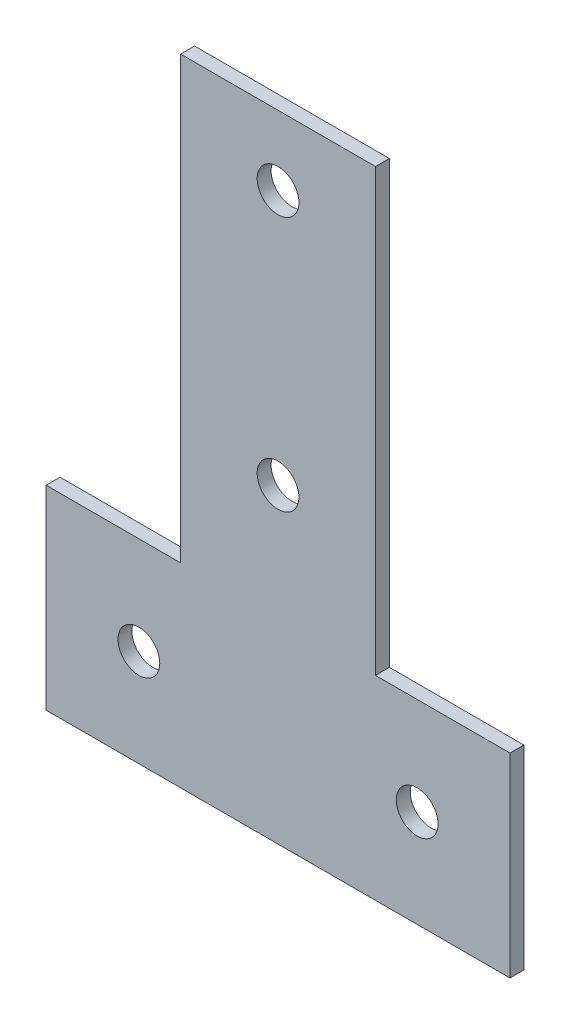
ISO-10303-21;
HEADER;
FILE_DESCRIPTION(('STEP AP214'),'2;1');
FILE_NAME('part.step','',(''),(''),'','','');
FILE_SCHEMA(('AUTOMOTIVE_DESIGN { 1 0 10303 214 1 1 1 1 }'));
ENDSEC;
DATA;
#1=APPLICATION_CONTEXT('core data for automotive mechanical design processes');
#2=APPLICATION_PROTOCOL_DEFINITION('international standard','automotive_design',2000,#1);
#3=PRODUCT_CONTEXT('',#1,'mechanical');
#4=PRODUCT('Part','Part','',(#3));
#5=PRODUCT_RELATED_PRODUCT_CATEGORY('part','',(#4));
#6=PRODUCT_DEFINITION_FORMATION('','',#4);
#7=PRODUCT_DEFINITION_CONTEXT('part definition',#1,'design');
#8=PRODUCT_DEFINITION('design','',#6,#7);
#9=PRODUCT_DEFINITION_SHAPE('','',#8);
#10=(LENGTH_UNIT() NAMED_UNIT(*) SI_UNIT(.MILLI.,.METRE.));
#11=(NAMED_UNIT(*) PLANE_ANGLE_UNIT() SI_UNIT($,.RADIAN.));
#12=(NAMED_UNIT(*) SI_UNIT($,.STERADIAN.) SOLID_ANGLE_UNIT());
#13=UNCERTAINTY_MEASURE_WITH_UNIT(LENGTH_MEASURE(1.E-05),#10,'distance_accuracy_value','');
#14=(GEOMETRIC_REPRESENTATION_CONTEXT(3) GLOBAL_UNCERTAINTY_ASSIGNED_CONTEXT((#13)) GLOBAL_UNIT_ASSIGNED_CONTEXT((#10,
#11,#12)) REPRESENTATION_CONTEXT('',''));
#15=CARTESIAN_POINT('',(0.,0.,0.));
#16=DIRECTION('',(0.,0.,1.));
#17=DIRECTION('',(1.,0.,0.));
#18=AXIS2_PLACEMENT_3D('',#15,#16,#17);
#19=CARTESIAN_POINT('',(0.,0.,3.));
#20=DIRECTION('',(0.,0.,1.));
#21=DIRECTION('',(1.,0.,0.));
#22=AXIS2_PLACEMENT_3D('',#19,#20,#21);
#23=PLANE('',#22);
#24=CARTESIAN_POINT('',(-30.,21.,3.));
#25=DIRECTION('',(0.,0.,1.));
#26=DIRECTION('',(1.,0.,0.));
#27=AXIS2_PLACEMENT_3D('',#24,#25,#26);
#28=CIRCLE('',#27,4.5);
#29=CARTESIAN_POINT('',(-25.5,21.,3.));
#30=VERTEX_POINT('',#29);
#31=EDGE_CURVE('E189',#30,#30,#28,.T.);
#32=ORIENTED_EDGE('',*,*,#31,.F.);
#33=EDGE_LOOP('',(#32));
#34=FACE_BOUND('',#33,.T.);
#35=CARTESIAN_POINT('',(0.,122.,3.));
#36=DIRECTION('',(0.,0.,1.));
#37=DIRECTION('',(1.,0.,0.));
#38=AXIS2_PLACEMENT_3D('',#35,#36,#37);
#39=CIRCLE('',#38,4.5);
#40=CARTESIAN_POINT('',(4.5,122.,3.));
#41=VERTEX_POINT('',#40);
#42=EDGE_CURVE('E135',#41,#41,#39,.T.);
#43=ORIENTED_EDGE('',*,*,#42,.F.);
#44=EDGE_LOOP('',(#43));
#45=FACE_BOUND('',#44,.T.);
#46=DIRECTION('',(0.,1.,0.));
#47=VECTOR('',#46,1.);
#48=CARTESIAN_POINT('',(50.,42.,3.));
#49=LINE('',#48,#47);
#50=CARTESIAN_POINT('',(50.,0.,3.));
#51=VERTEX_POINT('',#50);
#52=CARTESIAN_POINT('',(50.,42.,3.));
#53=VERTEX_POINT('',#52);
#54=EDGE_CURVE('E146',#51,#53,#49,.T.);
#55=ORIENTED_EDGE('',*,*,#54,.T.);
#56=DIRECTION('',(-1.,0.,0.));
#57=VECTOR('',#56,1.);
#58=CARTESIAN_POINT('',(21.,42.,3.));
#59=LINE('',#58,#57);
#60=CARTESIAN_POINT('',(21.,42.,3.));
#61=VERTEX_POINT('',#60);
#62=EDGE_CURVE('E94',#53,#61,#59,.T.);
#63=ORIENTED_EDGE('',*,*,#62,.T.);
#64=DIRECTION('',(0.,1.,0.));
#65=VECTOR('',#64,1.);
#66=CARTESIAN_POINT('',(21.,137.,3.));
#67=LINE('',#66,#65);
#68=CARTESIAN_POINT('',(21.,137.,3.));
#69=VERTEX_POINT('',#68);
#70=EDGE_CURVE('E161',#61,#69,#67,.T.);
#71=ORIENTED_EDGE('',*,*,#70,.T.);
#72=DIRECTION('',(-1.,0.,0.));
#73=VECTOR('',#72,1.);
#74=CARTESIAN_POINT('',(-21.,137.,3.));
#75=LINE('',#74,#73);
#76=CARTESIAN_POINT('',(-21.,137.,3.));
#77=VERTEX_POINT('',#76);
#78=EDGE_CURVE('E174',#69,#77,#75,.T.);
#79=ORIENTED_EDGE('',*,*,#78,.T.);
#80=DIRECTION('',(0.,-1.,0.));
#81=VECTOR('',#80,1.);
#82=CARTESIAN_POINT('',(-21.,42.,3.));
#83=LINE('',#82,#81);
#84=CARTESIAN_POINT('',(-21.,42.,3.));
#85=VERTEX_POINT('',#84);
#86=EDGE_CURVE('E113',#77,#85,#83,.T.);
#87=ORIENTED_EDGE('',*,*,#86,.T.);
#88=DIRECTION('',(-1.,0.,0.));
#89=VECTOR('',#88,1.);
#90=CARTESIAN_POINT('',(-50.,42.,3.));
#91=LINE('',#90,#89);
#92=CARTESIAN_POINT('',(-50.,42.,3.));
#93=VERTEX_POINT('',#92);
#94=EDGE_CURVE('E107',#85,#93,#91,.T.);
#95=ORIENTED_EDGE('',*,*,#94,.T.);
#96=DIRECTION('',(0.,-1.,0.));
#97=VECTOR('',#96,1.);
#98=CARTESIAN_POINT('',(-50.,0.,3.));
#99=LINE('',#98,#97);
#100=CARTESIAN_POINT('',(-50.,0.,3.));
#101=VERTEX_POINT('',#100);
#102=EDGE_CURVE('E111',#93,#101,#99,.T.);
#103=ORIENTED_EDGE('',*,*,#102,.T.);
#104=DIRECTION('',(1.,0.,0.));
#105=VECTOR('',#104,1.);
#106=CARTESIAN_POINT('',(-50.,0.,3.));
#107=LINE('',#106,#105);
#108=EDGE_CURVE('E51',#101,#51,#107,.T.);
#109=ORIENTED_EDGE('',*,*,#108,.T.);
#110=EDGE_LOOP('',(#55,#63,#71,#79,#87,#95,#103,#109));
#111=FACE_BOUND('',#110,.T.);
#112=CARTESIAN_POINT('',(0.,67.,3.));
#113=DIRECTION('',(0.,0.,1.));
#114=DIRECTION('',(1.,0.,0.));
#115=AXIS2_PLACEMENT_3D('',#112,#113,#114);
#116=CIRCLE('',#115,4.5);
#117=CARTESIAN_POINT('',(4.5,67.,3.));
#118=VERTEX_POINT('',#117);
#119=EDGE_CURVE('E183',#118,#118,#116,.T.);
#120=ORIENTED_EDGE('',*,*,#119,.F.);
#121=EDGE_LOOP('',(#120));
#122=FACE_BOUND('',#121,.T.);
#123=CARTESIAN_POINT('',(30.,21.,3.));
#124=DIRECTION('',(0.,0.,1.));
#125=DIRECTION('',(1.,0.,0.));
#126=AXIS2_PLACEMENT_3D('',#123,#124,#125);
#127=CIRCLE('',#126,4.5);
#128=CARTESIAN_POINT('',(34.5,21.,3.));
#129=VERTEX_POINT('',#128);
#130=EDGE_CURVE('E195',#129,#129,#127,.T.);
#131=ORIENTED_EDGE('',*,*,#130,.F.);
#132=EDGE_LOOP('',(#131));
#133=FACE_BOUND('',#132,.T.);
#134=ADVANCED_FACE('F34',(#34,#45,#111,#122,#133),#23,.T.);
#135=CARTESIAN_POINT('',(0.,0.,0.));
#136=DIRECTION('',(0.,0.,1.));
#137=DIRECTION('',(1.,0.,0.));
#138=AXIS2_PLACEMENT_3D('',#135,#136,#137);
#139=PLANE('',#138);
#140=DIRECTION('',(0.,1.,0.));
#141=VECTOR('',#140,1.);
#142=CARTESIAN_POINT('',(50.,42.,0.));
#143=LINE('',#142,#141);
#144=CARTESIAN_POINT('',(50.,0.,0.));
#145=VERTEX_POINT('',#144);
#146=CARTESIAN_POINT('',(50.,42.,0.));
#147=VERTEX_POINT('',#146);
#148=EDGE_CURVE('E131',#145,#147,#143,.T.);
#149=ORIENTED_EDGE('',*,*,#148,.F.);
#150=DIRECTION('',(1.,0.,0.));
#151=VECTOR('',#150,1.);
#152=CARTESIAN_POINT('',(-50.,0.,0.));
#153=LINE('',#152,#151);
#154=CARTESIAN_POINT('',(-50.,0.,0.));
#155=VERTEX_POINT('',#154);
#156=EDGE_CURVE('E86',#155,#145,#153,.T.);
#157=ORIENTED_EDGE('',*,*,#156,.F.);
#158=DIRECTION('',(0.,-1.,0.));
#159=VECTOR('',#158,1.);
#160=CARTESIAN_POINT('',(-50.,0.,0.));
#161=LINE('',#160,#159);
#162=CARTESIAN_POINT('',(-50.,42.,0.));
#163=VERTEX_POINT('',#162);
#164=EDGE_CURVE('E80',#163,#155,#161,.T.);
#165=ORIENTED_EDGE('',*,*,#164,.F.);
#166=DIRECTION('',(-1.,0.,0.));
#167=VECTOR('',#166,1.);
#168=CARTESIAN_POINT('',(-50.,42.,0.));
#169=LINE('',#168,#167);
#170=CARTESIAN_POINT('',(-21.,42.,0.));
#171=VERTEX_POINT('',#170);
#172=EDGE_CURVE('E121',#171,#163,#169,.T.);
#173=ORIENTED_EDGE('',*,*,#172,.F.);
#174=DIRECTION('',(0.,-1.,0.));
#175=VECTOR('',#174,1.);
#176=CARTESIAN_POINT('',(-21.,42.,0.));
#177=LINE('',#176,#175);
#178=CARTESIAN_POINT('',(-21.,137.,0.));
#179=VERTEX_POINT('',#178);
#180=EDGE_CURVE('E141',#179,#171,#177,.T.);
#181=ORIENTED_EDGE('',*,*,#180,.F.);
#182=DIRECTION('',(-1.,0.,0.));
#183=VECTOR('',#182,1.);
#184=CARTESIAN_POINT('',(-21.,137.,0.));
#185=LINE('',#184,#183);
#186=CARTESIAN_POINT('',(21.,137.,0.));
#187=VERTEX_POINT('',#186);
#188=EDGE_CURVE('E139',#187,#179,#185,.T.);
#189=ORIENTED_EDGE('',*,*,#188,.F.);
#190=DIRECTION('',(0.,1.,0.));
#191=VECTOR('',#190,1.);
#192=CARTESIAN_POINT('',(21.,137.,0.));
#193=LINE('',#192,#191);
#194=CARTESIAN_POINT('',(21.,42.,0.));
#195=VERTEX_POINT('',#194);
#196=EDGE_CURVE('E137',#195,#187,#193,.T.);
#197=ORIENTED_EDGE('',*,*,#196,.F.);
#198=DIRECTION('',(-1.,0.,0.));
#199=VECTOR('',#198,1.);
#200=CARTESIAN_POINT('',(21.,42.,0.));
#201=LINE('',#200,#199);
#202=EDGE_CURVE('E134',#147,#195,#201,.T.);
#203=ORIENTED_EDGE('',*,*,#202,.F.);
#204=EDGE_LOOP('',(#149,#157,#165,#173,#181,#189,#197,#203));
#205=FACE_BOUND('',#204,.T.);
#206=CARTESIAN_POINT('',(0.,122.,0.));
#207=DIRECTION('',(0.,0.,1.));
#208=DIRECTION('',(1.,0.,0.));
#209=AXIS2_PLACEMENT_3D('',#206,#207,#208);
#210=CIRCLE('',#209,4.5);
#211=CARTESIAN_POINT('',(4.5,122.,0.));
#212=VERTEX_POINT('',#211);
#213=EDGE_CURVE('E180',#212,#212,#210,.T.);
#214=ORIENTED_EDGE('',*,*,#213,.T.);
#215=EDGE_LOOP('',(#214));
#216=FACE_BOUND('',#215,.T.);
#217=CARTESIAN_POINT('',(0.,67.,0.));
#218=DIRECTION('',(0.,0.,1.));
#219=DIRECTION('',(1.,0.,0.));
#220=AXIS2_PLACEMENT_3D('',#217,#218,#219);
#221=CIRCLE('',#220,4.5);
#222=CARTESIAN_POINT('',(4.5,67.,0.));
#223=VERTEX_POINT('',#222);
#224=EDGE_CURVE('E186',#223,#223,#221,.T.);
#225=ORIENTED_EDGE('',*,*,#224,.T.);
#226=EDGE_LOOP('',(#225));
#227=FACE_BOUND('',#226,.T.);
#228=CARTESIAN_POINT('',(-30.,21.,0.));
#229=DIRECTION('',(0.,0.,1.));
#230=DIRECTION('',(1.,0.,0.));
#231=AXIS2_PLACEMENT_3D('',#228,#229,#230);
#232=CIRCLE('',#231,4.5);
#233=CARTESIAN_POINT('',(-25.5,21.,0.));
#234=VERTEX_POINT('',#233);
#235=EDGE_CURVE('E192',#234,#234,#232,.T.);
#236=ORIENTED_EDGE('',*,*,#235,.T.);
#237=EDGE_LOOP('',(#236));
#238=FACE_BOUND('',#237,.T.);
#239=CARTESIAN_POINT('',(30.,21.,0.));
#240=DIRECTION('',(0.,0.,1.));
#241=DIRECTION('',(1.,0.,0.));
#242=AXIS2_PLACEMENT_3D('',#239,#240,#241);
#243=CIRCLE('',#242,4.5);
#244=CARTESIAN_POINT('',(34.5,21.,0.));
#245=VERTEX_POINT('',#244);
#246=EDGE_CURVE('E198',#245,#245,#243,.T.);
#247=ORIENTED_EDGE('',*,*,#246,.T.);
#248=EDGE_LOOP('',(#247));
#249=FACE_BOUND('',#248,.T.);
#250=ADVANCED_FACE('F165',(#205,#216,#227,#238,#249),#139,.F.);
#251=CARTESIAN_POINT('',(50.,42.,3.));
#252=DIRECTION('',(-1.,0.,0.));
#253=DIRECTION('',(0.,0.,1.));
#254=AXIS2_PLACEMENT_3D('',#251,#252,#253);
#255=PLANE('',#254);
#256=ORIENTED_EDGE('',*,*,#148,.T.);
#257=DIRECTION('',(0.,0.,-1.));
#258=VECTOR('',#257,1.);
#259=CARTESIAN_POINT('',(50.,42.,3.));
#260=LINE('',#259,#258);
#261=EDGE_CURVE('E11',#53,#147,#260,.T.);
#262=ORIENTED_EDGE('',*,*,#261,.F.);
#263=ORIENTED_EDGE('',*,*,#54,.F.);
#264=DIRECTION('',(0.,0.,-1.));
#265=VECTOR('',#264,1.);
#266=CARTESIAN_POINT('',(50.,0.,3.));
#267=LINE('',#266,#265);
#268=EDGE_CURVE('E127',#51,#145,#267,.T.);
#269=ORIENTED_EDGE('',*,*,#268,.T.);
#270=EDGE_LOOP('',(#256,#262,#263,#269));
#271=FACE_BOUND('',#270,.T.);
#272=ADVANCED_FACE('F36',(#271),#255,.F.);
#273=CARTESIAN_POINT('',(21.,42.,3.));
#274=DIRECTION('',(0.,-1.,0.));
#275=DIRECTION('',(0.,0.,-1.));
#276=AXIS2_PLACEMENT_3D('',#273,#274,#275);
#277=PLANE('',#276);
#278=ORIENTED_EDGE('',*,*,#202,.T.);
#279=DIRECTION('',(0.,0.,-1.));
#280=VECTOR('',#279,1.);
#281=CARTESIAN_POINT('',(21.,42.,3.));
#282=LINE('',#281,#280);
#283=EDGE_CURVE('E43',#61,#195,#282,.T.);
#284=ORIENTED_EDGE('',*,*,#283,.F.);
#285=ORIENTED_EDGE('',*,*,#62,.F.);
#286=ORIENTED_EDGE('',*,*,#261,.T.);
#287=EDGE_LOOP('',(#278,#284,#285,#286));
#288=FACE_BOUND('',#287,.T.);
#289=ADVANCED_FACE('F232',(#288),#277,.F.);
#290=CARTESIAN_POINT('',(21.,137.,3.));
#291=DIRECTION('',(-1.,0.,0.));
#292=DIRECTION('',(0.,0.,1.));
#293=AXIS2_PLACEMENT_3D('',#290,#291,#292);
#294=PLANE('',#293);
#295=ORIENTED_EDGE('',*,*,#196,.T.);
#296=DIRECTION('',(0.,0.,-1.));
#297=VECTOR('',#296,1.);
#298=CARTESIAN_POINT('',(21.,137.,3.));
#299=LINE('',#298,#297);
#300=EDGE_CURVE('E153',#69,#187,#299,.T.);
#301=ORIENTED_EDGE('',*,*,#300,.F.);
#302=ORIENTED_EDGE('',*,*,#70,.F.);
#303=ORIENTED_EDGE('',*,*,#283,.T.);
#304=EDGE_LOOP('',(#295,#301,#302,#303));
#305=FACE_BOUND('',#304,.T.);
#306=ADVANCED_FACE('F159',(#305),#294,.F.);
#307=CARTESIAN_POINT('',(-21.,137.,3.));
#308=DIRECTION('',(0.,-1.,0.));
#309=DIRECTION('',(0.,0.,-1.));
#310=AXIS2_PLACEMENT_3D('',#307,#308,#309);
#311=PLANE('',#310);
#312=ORIENTED_EDGE('',*,*,#188,.T.);
#313=DIRECTION('',(0.,0.,-1.));
#314=VECTOR('',#313,1.);
#315=CARTESIAN_POINT('',(-21.,137.,3.));
#316=LINE('',#315,#314);
#317=EDGE_CURVE('E150',#77,#179,#316,.T.);
#318=ORIENTED_EDGE('',*,*,#317,.F.);
#319=ORIENTED_EDGE('',*,*,#78,.F.);
#320=ORIENTED_EDGE('',*,*,#300,.T.);
#321=EDGE_LOOP('',(#312,#318,#319,#320));
#322=FACE_BOUND('',#321,.T.);
#323=ADVANCED_FACE('F170',(#322),#311,.F.);
#324=CARTESIAN_POINT('',(-21.,42.,3.));
#325=DIRECTION('',(1.,0.,0.));
#326=DIRECTION('',(0.,0.,-1.));
#327=AXIS2_PLACEMENT_3D('',#324,#325,#326);
#328=PLANE('',#327);
#329=ORIENTED_EDGE('',*,*,#180,.T.);
#330=DIRECTION('',(0.,0.,-1.));
#331=VECTOR('',#330,1.);
#332=CARTESIAN_POINT('',(-21.,42.,3.));
#333=LINE('',#332,#331);
#334=EDGE_CURVE('E122',#85,#171,#333,.T.);
#335=ORIENTED_EDGE('',*,*,#334,.F.);
#336=ORIENTED_EDGE('',*,*,#86,.F.);
#337=ORIENTED_EDGE('',*,*,#317,.T.);
#338=EDGE_LOOP('',(#329,#335,#336,#337));
#339=FACE_BOUND('',#338,.T.);
#340=ADVANCED_FACE('F173',(#339),#328,.F.);
#341=CARTESIAN_POINT('',(-50.,42.,3.));
#342=DIRECTION('',(0.,-1.,0.));
#343=DIRECTION('',(0.,0.,-1.));
#344=AXIS2_PLACEMENT_3D('',#341,#342,#343);
#345=PLANE('',#344);
#346=ORIENTED_EDGE('',*,*,#172,.T.);
#347=DIRECTION('',(0.,0.,-1.));
#348=VECTOR('',#347,1.);
#349=CARTESIAN_POINT('',(-50.,42.,3.));
#350=LINE('',#349,#348);
#351=EDGE_CURVE('E118',#93,#163,#350,.T.);
#352=ORIENTED_EDGE('',*,*,#351,.F.);
#353=ORIENTED_EDGE('',*,*,#94,.F.);
#354=ORIENTED_EDGE('',*,*,#334,.T.);
#355=EDGE_LOOP('',(#346,#352,#353,#354));
#356=FACE_BOUND('',#355,.T.);
#357=ADVANCED_FACE('F119',(#356),#345,.F.);
#358=CARTESIAN_POINT('',(-50.,0.,3.));
#359=DIRECTION('',(1.,0.,0.));
#360=DIRECTION('',(0.,0.,-1.));
#361=AXIS2_PLACEMENT_3D('',#358,#359,#360);
#362=PLANE('',#361);
#363=ORIENTED_EDGE('',*,*,#164,.T.);
#364=DIRECTION('',(0.,0.,-1.));
#365=VECTOR('',#364,1.);
#366=CARTESIAN_POINT('',(-50.,0.,3.));
#367=LINE('',#366,#365);
#368=EDGE_CURVE('E123',#101,#155,#367,.T.);
#369=ORIENTED_EDGE('',*,*,#368,.F.);
#370=ORIENTED_EDGE('',*,*,#102,.F.);
#371=ORIENTED_EDGE('',*,*,#351,.T.);
#372=EDGE_LOOP('',(#363,#369,#370,#371));
#373=FACE_BOUND('',#372,.T.);
#374=ADVANCED_FACE('F125',(#373),#362,.F.);
#375=CARTESIAN_POINT('',(-50.,0.,3.));
#376=DIRECTION('',(0.,1.,0.));
#377=DIRECTION('',(-1.,0.,0.));
#378=AXIS2_PLACEMENT_3D('',#375,#376,#377);
#379=PLANE('',#378);
#380=ORIENTED_EDGE('',*,*,#156,.T.);
#381=ORIENTED_EDGE('',*,*,#268,.F.);
#382=ORIENTED_EDGE('',*,*,#108,.F.);
#383=ORIENTED_EDGE('',*,*,#368,.T.);
#384=EDGE_LOOP('',(#380,#381,#382,#383));
#385=FACE_BOUND('',#384,.T.);
#386=ADVANCED_FACE('F220',(#385),#379,.F.);
#387=CARTESIAN_POINT('',(0.,122.,3.));
#388=DIRECTION('',(0.,0.,-1.));
#389=DIRECTION('',(-1.,0.,0.));
#390=AXIS2_PLACEMENT_3D('',#387,#388,#389);
#391=CYLINDRICAL_SURFACE('',#390,4.5);
#392=ORIENTED_EDGE('',*,*,#42,.T.);
#393=EDGE_LOOP('',(#392));
#394=FACE_BOUND('',#393,.T.);
#395=ORIENTED_EDGE('',*,*,#213,.F.);
#396=EDGE_LOOP('',(#395));
#397=FACE_BOUND('',#396,.T.);
#398=ADVANCED_FACE('F217',(#394,#397),#391,.F.);
#399=CARTESIAN_POINT('',(0.,67.,3.));
#400=DIRECTION('',(0.,0.,-1.));
#401=DIRECTION('',(-1.,0.,0.));
#402=AXIS2_PLACEMENT_3D('',#399,#400,#401);
#403=CYLINDRICAL_SURFACE('',#402,4.5);
#404=ORIENTED_EDGE('',*,*,#119,.T.);
#405=EDGE_LOOP('',(#404));
#406=FACE_BOUND('',#405,.T.);
#407=ORIENTED_EDGE('',*,*,#224,.F.);
#408=EDGE_LOOP('',(#407));
#409=FACE_BOUND('',#408,.T.);
#410=ADVANCED_FACE('F296',(#406,#409),#403,.F.);
#411=CARTESIAN_POINT('',(-30.,21.,3.));
#412=DIRECTION('',(0.,0.,-1.));
#413=DIRECTION('',(-1.,0.,0.));
#414=AXIS2_PLACEMENT_3D('',#411,#412,#413);
#415=CYLINDRICAL_SURFACE('',#414,4.5);
#416=ORIENTED_EDGE('',*,*,#31,.T.);
#417=EDGE_LOOP('',(#416));
#418=FACE_BOUND('',#417,.T.);
#419=ORIENTED_EDGE('',*,*,#235,.F.);
#420=EDGE_LOOP('',(#419));
#421=FACE_BOUND('',#420,.T.);
#422=ADVANCED_FACE('F304',(#418,#421),#415,.F.);
#423=CARTESIAN_POINT('',(30.,21.,3.));
#424=DIRECTION('',(0.,0.,-1.));
#425=DIRECTION('',(-1.,0.,0.));
#426=AXIS2_PLACEMENT_3D('',#423,#424,#425);
#427=CYLINDRICAL_SURFACE('',#426,4.5);
#428=ORIENTED_EDGE('',*,*,#130,.T.);
#429=EDGE_LOOP('',(#428));
#430=FACE_BOUND('',#429,.T.);
#431=ORIENTED_EDGE('',*,*,#246,.F.);
#432=EDGE_LOOP('',(#431));
#433=FACE_BOUND('',#432,.T.);
#434=ADVANCED_FACE('F204',(#430,#433),#427,.F.);
#435=CLOSED_SHELL('',(#134,#250,#272,#289,#306,#323,#340,#357,#374,#386,#398,#410,#422,#434));
#436=MANIFOLD_SOLID_BREP('B2',#435);
#437=ADVANCED_BREP_SHAPE_REPRESENTATION('',(#18,#436),#14);
#438=SHAPE_DEFINITION_REPRESENTATION(#9,#437);
ENDSEC;
END-ISO-10303-21;
